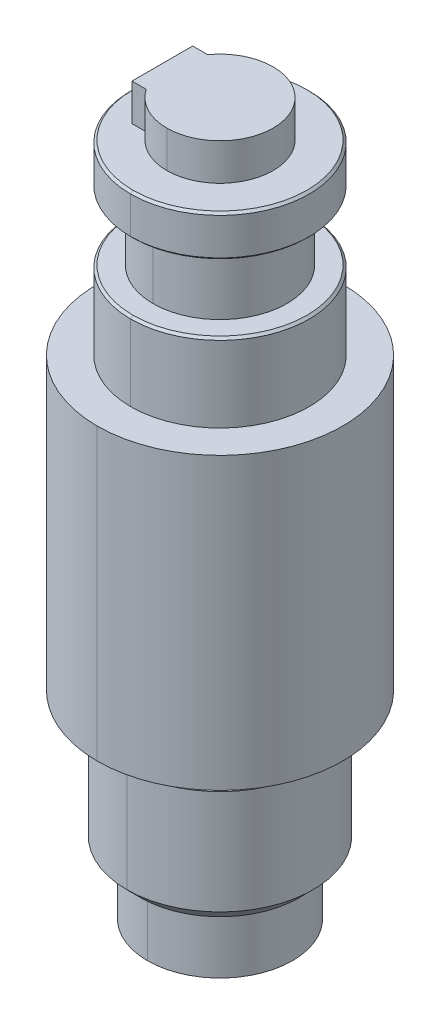
ISO-10303-21;
HEADER;
FILE_DESCRIPTION(('STEP AP214'),'2;1');
FILE_NAME('part.step','',(''),(''),'','','');
FILE_SCHEMA(('AUTOMOTIVE_DESIGN { 1 0 10303 214 1 1 1 1 }'));
ENDSEC;
DATA;
#1=APPLICATION_CONTEXT('core data for automotive mechanical design processes');
#2=APPLICATION_PROTOCOL_DEFINITION('international standard','automotive_design',2000,#1);
#3=PRODUCT_CONTEXT('',#1,'mechanical');
#4=PRODUCT('Part','Part','',(#3));
#5=PRODUCT_RELATED_PRODUCT_CATEGORY('part','',(#4));
#6=PRODUCT_DEFINITION_FORMATION('','',#4);
#7=PRODUCT_DEFINITION_CONTEXT('part definition',#1,'design');
#8=PRODUCT_DEFINITION('design','',#6,#7);
#9=PRODUCT_DEFINITION_SHAPE('','',#8);
#10=(LENGTH_UNIT() NAMED_UNIT(*) SI_UNIT(.MILLI.,.METRE.));
#11=(NAMED_UNIT(*) PLANE_ANGLE_UNIT() SI_UNIT($,.RADIAN.));
#12=(NAMED_UNIT(*) SI_UNIT($,.STERADIAN.) SOLID_ANGLE_UNIT());
#13=UNCERTAINTY_MEASURE_WITH_UNIT(LENGTH_MEASURE(1.E-05),#10,'distance_accuracy_value','');
#14=(GEOMETRIC_REPRESENTATION_CONTEXT(3) GLOBAL_UNCERTAINTY_ASSIGNED_CONTEXT((#13)) GLOBAL_UNIT_ASSIGNED_CONTEXT((#10,
#11,#12)) REPRESENTATION_CONTEXT('',''));
#15=CARTESIAN_POINT('',(0.,0.,0.));
#16=DIRECTION('',(0.,0.,1.));
#17=DIRECTION('',(1.,0.,0.));
#18=AXIS2_PLACEMENT_3D('',#15,#16,#17);
#19=CARTESIAN_POINT('',(18.1207496887531,35.6492982948195,29.9490663260963));
#20=DIRECTION('',(0.,1.,0.));
#21=DIRECTION('',(0.,0.,1.));
#22=AXIS2_PLACEMENT_3D('',#19,#20,#21);
#23=CYLINDRICAL_SURFACE('',#22,4.7592654031192);
#24=CARTESIAN_POINT('',(18.1207496887531,48.5409023996486,29.9490663260963));
#25=DIRECTION('',(0.,-1.,0.));
#26=DIRECTION('',(0.,0.,1.));
#27=AXIS2_PLACEMENT_3D('',#24,#25,#26);
#28=CIRCLE('',#27,4.7592654031192);
#29=CARTESIAN_POINT('',(18.1207496887531,48.5409023996486,25.1898009229771));
#30=VERTEX_POINT('',#29);
#31=CARTESIAN_POINT('',(18.1207496887531,48.5409023996486,34.7083317292155));
#32=VERTEX_POINT('',#31);
#33=EDGE_CURVE('E285',#30,#32,#28,.T.);
#34=ORIENTED_EDGE('',*,*,#33,.F.);
#35=DIRECTION('',(0.,1.,0.));
#36=VECTOR('',#35,1.);
#37=CARTESIAN_POINT('',(18.1207496887531,35.6492982948195,25.1898009229771));
#38=LINE('',#37,#36);
#39=CARTESIAN_POINT('',(18.1207496887531,51.8409023996486,25.1898009229771));
#40=VERTEX_POINT('',#39);
#41=EDGE_CURVE('E267',#30,#40,#38,.T.);
#42=ORIENTED_EDGE('',*,*,#41,.T.);
#43=CARTESIAN_POINT('',(18.1207496887531,51.8409023996486,29.9490663260963));
#44=DIRECTION('',(0.,1.,0.));
#45=DIRECTION('',(0.,0.,1.));
#46=AXIS2_PLACEMENT_3D('',#43,#44,#45);
#47=CIRCLE('',#46,4.7592654031192);
#48=CARTESIAN_POINT('',(18.1207496887531,51.8409023996486,34.7083317292155));
#49=VERTEX_POINT('',#48);
#50=EDGE_CURVE('E407',#49,#40,#47,.T.);
#51=ORIENTED_EDGE('',*,*,#50,.F.);
#52=DIRECTION('',(0.,1.,0.));
#53=VECTOR('',#52,1.);
#54=CARTESIAN_POINT('',(18.1207496887531,35.6492982948195,34.7083317292155));
#55=LINE('',#54,#53);
#56=EDGE_CURVE('E11',#32,#49,#55,.T.);
#57=ORIENTED_EDGE('',*,*,#56,.F.);
#58=EDGE_LOOP('',(#34,#42,#51,#57));
#59=FACE_BOUND('',#58,.T.);
#60=ADVANCED_FACE('F16',(#59),#23,.T.);
#61=CARTESIAN_POINT('',(18.1207496887531,35.6492982948195,29.9490663260963));
#62=DIRECTION('',(0.,1.,0.));
#63=DIRECTION('',(0.,0.,1.));
#64=AXIS2_PLACEMENT_3D('',#61,#62,#63);
#65=CYLINDRICAL_SURFACE('',#64,4.7592654031192);
#66=CARTESIAN_POINT('',(18.1207496887531,48.5409023996486,29.9490663260963));
#67=DIRECTION('',(0.,-1.,0.));
#68=DIRECTION('',(0.,0.,1.));
#69=AXIS2_PLACEMENT_3D('',#66,#67,#68);
#70=CIRCLE('',#69,4.7592654031192);
#71=CARTESIAN_POINT('',(14.185705016522,48.5409023996486,32.6260105923957));
#72=VERTEX_POINT('',#71);
#73=EDGE_CURVE('E289',#32,#72,#70,.T.);
#74=ORIENTED_EDGE('',*,*,#73,.F.);
#75=ORIENTED_EDGE('',*,*,#56,.T.);
#76=CARTESIAN_POINT('',(18.1207496887531,51.8409023996486,29.9490663260963));
#77=DIRECTION('',(0.,1.,0.));
#78=DIRECTION('',(0.,0.,1.));
#79=AXIS2_PLACEMENT_3D('',#76,#77,#78);
#80=CIRCLE('',#79,4.7592654031192);
#81=CARTESIAN_POINT('',(14.185705016522,51.8409023996486,32.6260105923957));
#82=VERTEX_POINT('',#81);
#83=EDGE_CURVE('E411',#82,#49,#80,.T.);
#84=ORIENTED_EDGE('',*,*,#83,.F.);
#85=DIRECTION('',(0.,1.,0.));
#86=VECTOR('',#85,1.);
#87=CARTESIAN_POINT('',(14.185705016522,35.6492982948195,32.6260105923957));
#88=LINE('',#87,#86);
#89=EDGE_CURVE('E449',#72,#82,#88,.T.);
#90=ORIENTED_EDGE('',*,*,#89,.F.);
#91=EDGE_LOOP('',(#74,#75,#84,#90));
#92=FACE_BOUND('',#91,.T.);
#93=ADVANCED_FACE('F1372',(#92),#65,.T.);
#94=CARTESIAN_POINT('',(18.1207496887531,-11.8590976003514,29.9490663260963));
#95=DIRECTION('',(0.,1.,0.));
#96=DIRECTION('',(0.,0.,1.));
#97=AXIS2_PLACEMENT_3D('',#94,#95,#96);
#98=CONICAL_SURFACE('',#97,6.60071544444866,1.15191730631626);
#99=CARTESIAN_POINT('',(18.1207496887531,-13.8590976003514,29.9490663260963));
#100=DIRECTION('',(0.,-1.,0.));
#101=DIRECTION('',(0.,0.,-1.));
#102=AXIS2_PLACEMENT_3D('',#99,#100,#101);
#103=CIRCLE('',#102,2.10864189664013);
#104=CARTESIAN_POINT('',(18.1207496887531,-13.8590976003514,27.8404244294561));
#105=VERTEX_POINT('',#104);
#106=CARTESIAN_POINT('',(18.1207496887531,-13.8590976003514,32.0577082227364));
#107=VERTEX_POINT('',#106);
#108=EDGE_CURVE('E428',#105,#107,#103,.T.);
#109=ORIENTED_EDGE('',*,*,#108,.F.);
#110=DIRECTION('',(0.,0.406736643075798,-0.913545457642602));
#111=VECTOR('',#110,1.);
#112=CARTESIAN_POINT('',(18.1207496887531,-11.8590976003514,23.3483508816477));
#113=LINE('',#112,#111);
#114=CARTESIAN_POINT('',(18.1207496887531,-11.9039390052735,23.4490663260963));
#115=VERTEX_POINT('',#114);
#116=EDGE_CURVE('E372',#105,#115,#113,.T.);
#117=ORIENTED_EDGE('',*,*,#116,.T.);
#118=CARTESIAN_POINT('',(18.1207496887531,-11.9039390052735,29.9490663260963));
#119=DIRECTION('',(0.,1.,0.));
#120=DIRECTION('',(0.,0.,1.));
#121=AXIS2_PLACEMENT_3D('',#118,#119,#120);
#122=CIRCLE('',#121,6.5);
#123=CARTESIAN_POINT('',(18.1207496887531,-11.9039390052735,36.4490663260963));
#124=VERTEX_POINT('',#123);
#125=EDGE_CURVE('E348',#124,#115,#122,.T.);
#126=ORIENTED_EDGE('',*,*,#125,.F.);
#127=DIRECTION('',(0.,0.406736643075798,0.913545457642602));
#128=VECTOR('',#127,1.);
#129=CARTESIAN_POINT('',(18.1207496887531,-11.8590976003514,36.549781770545));
#130=LINE('',#129,#128);
#131=EDGE_CURVE('E371',#107,#124,#130,.T.);
#132=ORIENTED_EDGE('',*,*,#131,.F.);
#133=EDGE_LOOP('',(#109,#117,#126,#132));
#134=FACE_BOUND('',#133,.T.);
#135=ADVANCED_FACE('F1376',(#134),#98,.T.);
#136=CARTESIAN_POINT('',(18.1207496887531,3.87090239964861,29.9490663260963));
#137=DIRECTION('',(0.,-1.,0.));
#138=DIRECTION('',(0.,0.,-1.));
#139=AXIS2_PLACEMENT_3D('',#136,#137,#138);
#140=CONICAL_SURFACE('',#139,8.35,0.78539816339745);
#141=CARTESIAN_POINT('',(18.1207496887531,5.14090239964862,29.9490663260963));
#142=DIRECTION('',(0.,1.,0.));
#143=DIRECTION('',(0.,0.,1.));
#144=AXIS2_PLACEMENT_3D('',#141,#142,#143);
#145=CIRCLE('',#144,7.08);
#146=CARTESIAN_POINT('',(18.1207496887531,5.14090239964862,37.0290663260963));
#147=VERTEX_POINT('',#146);
#148=CARTESIAN_POINT('',(18.1207496887531,5.14090239964862,22.8690663260963));
#149=VERTEX_POINT('',#148);
#150=EDGE_CURVE('E524',#147,#149,#145,.T.);
#151=ORIENTED_EDGE('',*,*,#150,.F.);
#152=DIRECTION('',(0.,-0.707106781186547,0.707106781186549));
#153=VECTOR('',#152,1.);
#154=CARTESIAN_POINT('',(18.1207496887531,3.87090239964861,38.2990663260963));
#155=LINE('',#154,#153);
#156=CARTESIAN_POINT('',(18.1207496887531,3.87090239964861,38.2990663260963));
#157=VERTEX_POINT('',#156);
#158=EDGE_CURVE('E424',#147,#157,#155,.T.);
#159=ORIENTED_EDGE('',*,*,#158,.T.);
#160=CARTESIAN_POINT('',(18.1207496887531,3.87090239964861,29.9490663260963));
#161=DIRECTION('',(0.,-1.,0.));
#162=DIRECTION('',(0.,0.,1.));
#163=AXIS2_PLACEMENT_3D('',#160,#161,#162);
#164=CIRCLE('',#163,8.35);
#165=CARTESIAN_POINT('',(18.1207496887531,3.87090239964861,21.5990663260963));
#166=VERTEX_POINT('',#165);
#167=EDGE_CURVE('E301',#166,#157,#164,.T.);
#168=ORIENTED_EDGE('',*,*,#167,.F.);
#169=DIRECTION('',(0.,-0.707106781186547,-0.707106781186549));
#170=VECTOR('',#169,1.);
#171=CARTESIAN_POINT('',(18.1207496887531,3.87090239964861,21.5990663260963));
#172=LINE('',#171,#170);
#173=EDGE_CURVE('E385',#149,#166,#172,.T.);
#174=ORIENTED_EDGE('',*,*,#173,.F.);
#175=EDGE_LOOP('',(#151,#159,#168,#174));
#176=FACE_BOUND('',#175,.T.);
#177=ADVANCED_FACE('F1087',(#176),#140,.T.);
#178=CARTESIAN_POINT('',(18.1207496887531,-6.73409760035138,29.9490663260963));
#179=DIRECTION('',(0.,1.,0.));
#180=DIRECTION('',(0.,0.,1.));
#181=AXIS2_PLACEMENT_3D('',#178,#179,#180);
#182=CONICAL_SURFACE('',#181,7.08,0.785398163397445);
#183=CARTESIAN_POINT('',(18.1207496887531,-6.73409760035138,29.9490663260963));
#184=DIRECTION('',(0.,-1.,0.));
#185=DIRECTION('',(0.,0.,-1.));
#186=AXIS2_PLACEMENT_3D('',#183,#184,#185);
#187=CIRCLE('',#186,7.08);
#188=CARTESIAN_POINT('',(18.1207496887531,-6.73409760035138,22.8690663260963));
#189=VERTEX_POINT('',#188);
#190=CARTESIAN_POINT('',(18.1207496887531,-6.73409760035138,37.0290663260963));
#191=VERTEX_POINT('',#190);
#192=EDGE_CURVE('E445',#189,#191,#187,.T.);
#193=ORIENTED_EDGE('',*,*,#192,.F.);
#194=DIRECTION('',(0.,0.707106781186551,-0.707106781186545));
#195=VECTOR('',#194,1.);
#196=CARTESIAN_POINT('',(18.1207496887531,-6.73409760035138,22.8690663260963));
#197=LINE('',#196,#195);
#198=CARTESIAN_POINT('',(18.1207496887531,-5.46409760035138,21.5990663260963));
#199=VERTEX_POINT('',#198);
#200=EDGE_CURVE('E329',#189,#199,#197,.T.);
#201=ORIENTED_EDGE('',*,*,#200,.T.);
#202=CARTESIAN_POINT('',(18.1207496887531,-5.46409760035138,29.9490663260963));
#203=DIRECTION('',(0.,1.,0.));
#204=DIRECTION('',(0.,0.,-1.));
#205=AXIS2_PLACEMENT_3D('',#202,#203,#204);
#206=CIRCLE('',#205,8.35);
#207=CARTESIAN_POINT('',(18.1207496887531,-5.46409760035138,38.2990663260963));
#208=VERTEX_POINT('',#207);
#209=EDGE_CURVE('E27',#208,#199,#206,.T.);
#210=ORIENTED_EDGE('',*,*,#209,.F.);
#211=DIRECTION('',(0.,0.707106781186551,0.707106781186545));
#212=VECTOR('',#211,1.);
#213=CARTESIAN_POINT('',(18.1207496887531,-6.73409760035138,37.0290663260963));
#214=LINE('',#213,#212);
#215=EDGE_CURVE('E440',#191,#208,#214,.T.);
#216=ORIENTED_EDGE('',*,*,#215,.F.);
#217=EDGE_LOOP('',(#193,#201,#210,#216));
#218=FACE_BOUND('',#217,.T.);
#219=ADVANCED_FACE('F650',(#218),#182,.T.);
#220=CARTESIAN_POINT('',(18.1207496887531,5.14090239964862,29.9490663260963));
#221=DIRECTION('',(0.,-1.,0.));
#222=DIRECTION('',(0.,0.,-1.));
#223=AXIS2_PLACEMENT_3D('',#220,#221,#222);
#224=CYLINDRICAL_SURFACE('',#223,8.35);
#225=ORIENTED_EDGE('',*,*,#167,.T.);
#226=DIRECTION('',(0.,-1.,0.));
#227=VECTOR('',#226,1.);
#228=CARTESIAN_POINT('',(18.1207496887531,5.14090239964862,38.2990663260963));
#229=LINE('',#228,#227);
#230=EDGE_CURVE('E313',#157,#208,#229,.T.);
#231=ORIENTED_EDGE('',*,*,#230,.T.);
#232=ORIENTED_EDGE('',*,*,#209,.T.);
#233=DIRECTION('',(0.,-1.,0.));
#234=VECTOR('',#233,1.);
#235=CARTESIAN_POINT('',(18.1207496887531,5.14090239964862,21.5990663260963));
#236=LINE('',#235,#234);
#237=EDGE_CURVE('E317',#166,#199,#236,.T.);
#238=ORIENTED_EDGE('',*,*,#237,.F.);
#239=EDGE_LOOP('',(#225,#231,#232,#238));
#240=FACE_BOUND('',#239,.T.);
#241=ADVANCED_FACE('F654',(#240),#224,.T.);
#242=CARTESIAN_POINT('',(18.1207496887531,11.6506787104989,29.9490663260963));
#243=DIRECTION('',(0.,-1.,0.));
#244=DIRECTION('',(0.,0.,-1.));
#245=AXIS2_PLACEMENT_3D('',#242,#243,#244);
#246=CYLINDRICAL_SURFACE('',#245,6.5);
#247=CARTESIAN_POINT('',(18.1207496887531,-6.73409760035138,29.9490663260963));
#248=DIRECTION('',(0.,1.,0.));
#249=DIRECTION('',(0.,0.,-1.));
#250=AXIS2_PLACEMENT_3D('',#247,#248,#249);
#251=CIRCLE('',#250,6.5);
#252=CARTESIAN_POINT('',(18.1207496887531,-6.73409760035138,36.4490663260963));
#253=VERTEX_POINT('',#252);
#254=CARTESIAN_POINT('',(18.1207496887531,-6.73409760035138,23.4490663260963));
#255=VERTEX_POINT('',#254);
#256=EDGE_CURVE('E261',#253,#255,#251,.T.);
#257=ORIENTED_EDGE('',*,*,#256,.F.);
#258=DIRECTION('',(0.,-1.,0.));
#259=VECTOR('',#258,1.);
#260=CARTESIAN_POINT('',(18.1207496887531,11.6506787104989,36.4490663260963));
#261=LINE('',#260,#259);
#262=EDGE_CURVE('E256',#253,#124,#261,.T.);
#263=ORIENTED_EDGE('',*,*,#262,.T.);
#264=ORIENTED_EDGE('',*,*,#125,.T.);
#265=DIRECTION('',(0.,-1.,0.));
#266=VECTOR('',#265,1.);
#267=CARTESIAN_POINT('',(18.1207496887531,11.6506787104989,23.4490663260963));
#268=LINE('',#267,#266);
#269=EDGE_CURVE('E260',#255,#115,#268,.T.);
#270=ORIENTED_EDGE('',*,*,#269,.F.);
#271=EDGE_LOOP('',(#257,#263,#264,#270));
#272=FACE_BOUND('',#271,.T.);
#273=ADVANCED_FACE('F635',(#272),#246,.T.);
#274=CARTESIAN_POINT('',(18.1207496887531,38.8409023996486,29.9490663260963));
#275=DIRECTION('',(0.,-1.,0.));
#276=DIRECTION('',(0.,0.,-1.));
#277=AXIS2_PLACEMENT_3D('',#274,#275,#276);
#278=CONICAL_SURFACE('',#277,7.8,0.785398163397448);
#279=CARTESIAN_POINT('',(18.1207496887531,38.8409023996486,29.9490663260963));
#280=DIRECTION('',(0.,1.,0.));
#281=DIRECTION('',(0.,0.,1.));
#282=AXIS2_PLACEMENT_3D('',#279,#280,#281);
#283=CIRCLE('',#282,7.8);
#284=CARTESIAN_POINT('',(18.1207496887531,38.8409023996486,37.7490663260963));
#285=VERTEX_POINT('',#284);
#286=CARTESIAN_POINT('',(18.1207496887531,38.8409023996486,22.1490663260963));
#287=VERTEX_POINT('',#286);
#288=EDGE_CURVE('E272',#285,#287,#283,.T.);
#289=ORIENTED_EDGE('',*,*,#288,.F.);
#290=DIRECTION('',(0.,-0.707106781186548,0.707106781186548));
#291=VECTOR('',#290,1.);
#292=CARTESIAN_POINT('',(18.1207496887531,38.8409023996486,37.7490663260963));
#293=LINE('',#292,#291);
#294=CARTESIAN_POINT('',(18.1207496887531,38.6409023996487,37.9490663260963));
#295=VERTEX_POINT('',#294);
#296=EDGE_CURVE('E322',#285,#295,#293,.T.);
#297=ORIENTED_EDGE('',*,*,#296,.T.);
#298=CARTESIAN_POINT('',(18.1207496887531,38.6409023996487,29.9490663260963));
#299=DIRECTION('',(0.,-1.,0.));
#300=DIRECTION('',(0.,0.,1.));
#301=AXIS2_PLACEMENT_3D('',#298,#299,#300);
#302=CIRCLE('',#301,8.);
#303=CARTESIAN_POINT('',(18.1207496887531,38.6409023996487,21.9490663260963));
#304=VERTEX_POINT('',#303);
#305=EDGE_CURVE('E221',#304,#295,#302,.T.);
#306=ORIENTED_EDGE('',*,*,#305,.F.);
#307=DIRECTION('',(0.,-0.707106781186548,-0.707106781186548));
#308=VECTOR('',#307,1.);
#309=CARTESIAN_POINT('',(18.1207496887531,38.8409023996486,22.1490663260963));
#310=LINE('',#309,#308);
#311=EDGE_CURVE('E307',#287,#304,#310,.T.);
#312=ORIENTED_EDGE('',*,*,#311,.F.);
#313=EDGE_LOOP('',(#289,#297,#306,#312));
#314=FACE_BOUND('',#313,.T.);
#315=ADVANCED_FACE('F1097',(#314),#278,.T.);
#316=CARTESIAN_POINT('',(18.1207496887531,30.5409023996486,29.8795368386777));
#317=DIRECTION('',(0.,-1.,0.));
#318=DIRECTION('',(0.,0.,-1.));
#319=AXIS2_PLACEMENT_3D('',#316,#317,#318);
#320=CYLINDRICAL_SURFACE('',#319,5.3330761790222);
#321=CARTESIAN_POINT('',(18.1207496887531,5.84090239964862,29.8795368386777));
#322=DIRECTION('',(0.,-1.,0.));
#323=DIRECTION('',(0.,0.,-1.));
#324=AXIS2_PLACEMENT_3D('',#321,#322,#323);
#325=CIRCLE('',#324,5.3330761790222);
#326=CARTESIAN_POINT('',(18.1207496887531,5.84090239964862,24.5464606596556));
#327=VERTEX_POINT('',#326);
#328=CARTESIAN_POINT('',(18.1207496887531,5.84090239964862,35.2126130176999));
#329=VERTEX_POINT('',#328);
#330=EDGE_CURVE('E281',#327,#329,#325,.T.);
#331=ORIENTED_EDGE('',*,*,#330,.T.);
#332=DIRECTION('',(0.,-1.,0.));
#333=VECTOR('',#332,1.);
#334=CARTESIAN_POINT('',(18.1207496887531,30.5409023996486,35.2126130176999));
#335=LINE('',#334,#333);
#336=CARTESIAN_POINT('',(18.1207496887531,5.14090239964862,35.2126130176999));
#337=VERTEX_POINT('',#336);
#338=EDGE_CURVE('E273',#329,#337,#335,.T.);
#339=ORIENTED_EDGE('',*,*,#338,.T.);
#340=CARTESIAN_POINT('',(18.1207496887531,5.14090239964862,29.8795368386777));
#341=DIRECTION('',(0.,1.,0.));
#342=DIRECTION('',(0.,0.,1.));
#343=AXIS2_PLACEMENT_3D('',#340,#341,#342);
#344=CIRCLE('',#343,5.3330761790222);
#345=CARTESIAN_POINT('',(18.1207496887531,5.14090239964862,24.5464606596556));
#346=VERTEX_POINT('',#345);
#347=EDGE_CURVE('E318',#337,#346,#344,.T.);
#348=ORIENTED_EDGE('',*,*,#347,.T.);
#349=DIRECTION('',(0.,-1.,0.));
#350=VECTOR('',#349,1.);
#351=CARTESIAN_POINT('',(18.1207496887531,30.5409023996486,24.5464606596556));
#352=LINE('',#351,#350);
#353=EDGE_CURVE('E268',#327,#346,#352,.T.);
#354=ORIENTED_EDGE('',*,*,#353,.F.);
#355=EDGE_LOOP('',(#331,#339,#348,#354));
#356=FACE_BOUND('',#355,.T.);
#357=ADVANCED_FACE('F511',(#356),#320,.T.);
#358=CARTESIAN_POINT('',(18.1207496887531,5.84090239964862,29.9490663260963));
#359=DIRECTION('',(0.,-1.,0.));
#360=DIRECTION('',(0.,0.,-1.));
#361=AXIS2_PLACEMENT_3D('',#358,#359,#360);
#362=CYLINDRICAL_SURFACE('',#361,6.);
#363=CARTESIAN_POINT('',(18.1207496887531,44.8409023996486,29.9490663260963));
#364=DIRECTION('',(0.,-1.,0.));
#365=DIRECTION('',(0.,0.,-1.));
#366=AXIS2_PLACEMENT_3D('',#363,#364,#365);
#367=CIRCLE('',#366,6.);
#368=CARTESIAN_POINT('',(18.1207496887531,44.8409023996486,23.9490663260963));
#369=VERTEX_POINT('',#368);
#370=CARTESIAN_POINT('',(18.1207496887531,44.8409023996486,35.9490663260963));
#371=VERTEX_POINT('',#370);
#372=EDGE_CURVE('E384',#369,#371,#367,.T.);
#373=ORIENTED_EDGE('',*,*,#372,.T.);
#374=DIRECTION('',(0.,-1.,0.));
#375=VECTOR('',#374,1.);
#376=CARTESIAN_POINT('',(18.1207496887531,5.84090239964862,35.9490663260963));
#377=LINE('',#376,#375);
#378=CARTESIAN_POINT('',(18.1207496887531,38.8409023996486,35.9490663260963));
#379=VERTEX_POINT('',#378);
#380=EDGE_CURVE('E327',#371,#379,#377,.T.);
#381=ORIENTED_EDGE('',*,*,#380,.T.);
#382=CARTESIAN_POINT('',(18.1207496887531,38.8409023996486,29.9490663260963));
#383=DIRECTION('',(0.,-1.,0.));
#384=DIRECTION('',(0.,0.,-1.));
#385=AXIS2_PLACEMENT_3D('',#382,#383,#384);
#386=CIRCLE('',#385,6.);
#387=CARTESIAN_POINT('',(18.1207496887531,38.8409023996486,23.9490663260963));
#388=VERTEX_POINT('',#387);
#389=EDGE_CURVE('E328',#388,#379,#386,.T.);
#390=ORIENTED_EDGE('',*,*,#389,.F.);
#391=DIRECTION('',(0.,-1.,0.));
#392=VECTOR('',#391,1.);
#393=CARTESIAN_POINT('',(18.1207496887531,5.84090239964862,23.9490663260963));
#394=LINE('',#393,#392);
#395=EDGE_CURVE('E308',#369,#388,#394,.T.);
#396=ORIENTED_EDGE('',*,*,#395,.F.);
#397=EDGE_LOOP('',(#373,#381,#390,#396));
#398=FACE_BOUND('',#397,.T.);
#399=ADVANCED_FACE('F1237',(#398),#362,.T.);
#400=CARTESIAN_POINT('',(18.1207496887531,44.8409023996486,29.9490663260963));
#401=DIRECTION('',(0.,1.,0.));
#402=DIRECTION('',(0.,0.,1.));
#403=AXIS2_PLACEMENT_3D('',#400,#401,#402);
#404=CONICAL_SURFACE('',#403,7.8,0.785398163397448);
#405=CARTESIAN_POINT('',(18.1207496887531,44.8409023996486,29.9490663260963));
#406=DIRECTION('',(0.,-1.,0.));
#407=DIRECTION('',(0.,0.,-1.));
#408=AXIS2_PLACEMENT_3D('',#405,#406,#407);
#409=CIRCLE('',#408,7.8);
#410=CARTESIAN_POINT('',(18.1207496887531,44.8409023996486,22.1490663260963));
#411=VERTEX_POINT('',#410);
#412=CARTESIAN_POINT('',(18.1207496887531,44.8409023996486,37.7490663260963));
#413=VERTEX_POINT('',#412);
#414=EDGE_CURVE('E492',#411,#413,#409,.T.);
#415=ORIENTED_EDGE('',*,*,#414,.F.);
#416=DIRECTION('',(0.,0.707106781186548,-0.707106781186548));
#417=VECTOR('',#416,1.);
#418=CARTESIAN_POINT('',(18.1207496887531,44.8409023996486,22.1490663260963));
#419=LINE('',#418,#417);
#420=CARTESIAN_POINT('',(18.1207496887531,45.0409023996486,21.9490663260963));
#421=VERTEX_POINT('',#420);
#422=EDGE_CURVE('E380',#411,#421,#419,.T.);
#423=ORIENTED_EDGE('',*,*,#422,.T.);
#424=CARTESIAN_POINT('',(18.1207496887531,45.0409023996486,29.9490663260963));
#425=DIRECTION('',(0.,1.,0.));
#426=DIRECTION('',(0.,0.,-1.));
#427=AXIS2_PLACEMENT_3D('',#424,#425,#426);
#428=CIRCLE('',#427,8.);
#429=CARTESIAN_POINT('',(18.1207496887531,45.0409023996486,37.9490663260963));
#430=VERTEX_POINT('',#429);
#431=EDGE_CURVE('E220',#430,#421,#428,.T.);
#432=ORIENTED_EDGE('',*,*,#431,.F.);
#433=DIRECTION('',(0.,0.707106781186548,0.707106781186548));
#434=VECTOR('',#433,1.);
#435=CARTESIAN_POINT('',(18.1207496887531,44.8409023996486,37.7490663260963));
#436=LINE('',#435,#434);
#437=EDGE_CURVE('E276',#413,#430,#436,.T.);
#438=ORIENTED_EDGE('',*,*,#437,.F.);
#439=EDGE_LOOP('',(#415,#423,#432,#438));
#440=FACE_BOUND('',#439,.T.);
#441=ADVANCED_FACE('F18',(#440),#404,.T.);
#442=CARTESIAN_POINT('',(18.1207496887531,5.84090239964862,29.9490663260963));
#443=DIRECTION('',(0.,-1.,0.));
#444=DIRECTION('',(0.,0.,-1.));
#445=AXIS2_PLACEMENT_3D('',#442,#443,#444);
#446=CYLINDRICAL_SURFACE('',#445,8.);
#447=CARTESIAN_POINT('',(18.1207496887531,48.3409023996486,29.9490663260963));
#448=DIRECTION('',(0.,-1.,0.));
#449=DIRECTION('',(0.,0.,1.));
#450=AXIS2_PLACEMENT_3D('',#447,#448,#449);
#451=CIRCLE('',#450,8.);
#452=CARTESIAN_POINT('',(18.1207496887531,48.3409023996486,21.9490663260963));
#453=VERTEX_POINT('',#452);
#454=CARTESIAN_POINT('',(18.1207496887531,48.3409023996486,37.9490663260963));
#455=VERTEX_POINT('',#454);
#456=EDGE_CURVE('E208',#453,#455,#451,.T.);
#457=ORIENTED_EDGE('',*,*,#456,.T.);
#458=DIRECTION('',(0.,-1.,0.));
#459=VECTOR('',#458,1.);
#460=CARTESIAN_POINT('',(18.1207496887531,5.84090239964862,37.9490663260963));
#461=LINE('',#460,#459);
#462=EDGE_CURVE('E243',#455,#430,#461,.T.);
#463=ORIENTED_EDGE('',*,*,#462,.T.);
#464=ORIENTED_EDGE('',*,*,#431,.T.);
#465=DIRECTION('',(0.,-1.,0.));
#466=VECTOR('',#465,1.);
#467=CARTESIAN_POINT('',(18.1207496887531,5.84090239964862,21.9490663260963));
#468=LINE('',#467,#466);
#469=EDGE_CURVE('E234',#453,#421,#468,.T.);
#470=ORIENTED_EDGE('',*,*,#469,.F.);
#471=EDGE_LOOP('',(#457,#463,#464,#470));
#472=FACE_BOUND('',#471,.T.);
#473=ADVANCED_FACE('F235',(#472),#446,.T.);
#474=CARTESIAN_POINT('',(18.1207496887531,48.3409023996486,29.9490663260963));
#475=DIRECTION('',(0.,-1.,0.));
#476=DIRECTION('',(0.,0.,-1.));
#477=AXIS2_PLACEMENT_3D('',#474,#475,#476);
#478=CONICAL_SURFACE('',#477,8.,0.78539816339744);
#479=CARTESIAN_POINT('',(18.1207496887531,48.5409023996486,29.9490663260963));
#480=DIRECTION('',(0.,1.,0.));
#481=DIRECTION('',(0.,0.,1.));
#482=AXIS2_PLACEMENT_3D('',#479,#480,#481);
#483=CIRCLE('',#482,7.8);
#484=CARTESIAN_POINT('',(18.1207496887531,48.5409023996486,37.7490663260963));
#485=VERTEX_POINT('',#484);
#486=CARTESIAN_POINT('',(18.1207496887531,48.5409023996486,22.1490663260963));
#487=VERTEX_POINT('',#486);
#488=EDGE_CURVE('E231',#485,#487,#483,.T.);
#489=ORIENTED_EDGE('',*,*,#488,.F.);
#490=DIRECTION('',(0.,-0.707106781186554,0.707106781186541));
#491=VECTOR('',#490,1.);
#492=CARTESIAN_POINT('',(18.1207496887531,48.3409023996486,37.9490663260963));
#493=LINE('',#492,#491);
#494=EDGE_CURVE('E214',#485,#455,#493,.T.);
#495=ORIENTED_EDGE('',*,*,#494,.T.);
#496=ORIENTED_EDGE('',*,*,#456,.F.);
#497=DIRECTION('',(0.,-0.707106781186554,-0.707106781186541));
#498=VECTOR('',#497,1.);
#499=CARTESIAN_POINT('',(18.1207496887531,48.3409023996486,21.9490663260963));
#500=LINE('',#499,#498);
#501=EDGE_CURVE('E211',#487,#453,#500,.T.);
#502=ORIENTED_EDGE('',*,*,#501,.F.);
#503=EDGE_LOOP('',(#489,#495,#496,#502));
#504=FACE_BOUND('',#503,.T.);
#505=ADVANCED_FACE('F210',(#504),#478,.T.);
#506=CARTESIAN_POINT('',(18.1207496887531,5.84090239964862,29.9490663260963));
#507=DIRECTION('',(0.,-1.,0.));
#508=DIRECTION('',(0.,0.,-1.));
#509=AXIS2_PLACEMENT_3D('',#506,#507,#508);
#510=CYLINDRICAL_SURFACE('',#509,8.);
#511=ORIENTED_EDGE('',*,*,#305,.T.);
#512=DIRECTION('',(0.,-1.,0.));
#513=VECTOR('',#512,1.);
#514=CARTESIAN_POINT('',(18.1207496887531,5.84090239964862,37.9490663260963));
#515=LINE('',#514,#513);
#516=CARTESIAN_POINT('',(18.1207496887531,31.8409023996486,37.9490663260963));
#517=VERTEX_POINT('',#516);
#518=EDGE_CURVE('E296',#295,#517,#515,.T.);
#519=ORIENTED_EDGE('',*,*,#518,.T.);
#520=CARTESIAN_POINT('',(18.1207496887531,31.8409023996486,29.9490663260963));
#521=DIRECTION('',(0.,1.,0.));
#522=DIRECTION('',(0.,0.,1.));
#523=AXIS2_PLACEMENT_3D('',#520,#521,#522);
#524=CIRCLE('',#523,8.);
#525=CARTESIAN_POINT('',(18.1207496887531,31.8409023996486,21.9490663260963));
#526=VERTEX_POINT('',#525);
#527=EDGE_CURVE('E42',#517,#526,#524,.T.);
#528=ORIENTED_EDGE('',*,*,#527,.T.);
#529=DIRECTION('',(0.,-1.,0.));
#530=VECTOR('',#529,1.);
#531=CARTESIAN_POINT('',(18.1207496887531,5.84090239964862,21.9490663260963));
#532=LINE('',#531,#530);
#533=EDGE_CURVE('E299',#304,#526,#532,.T.);
#534=ORIENTED_EDGE('',*,*,#533,.F.);
#535=EDGE_LOOP('',(#511,#519,#528,#534));
#536=FACE_BOUND('',#535,.T.);
#537=ADVANCED_FACE('F1126',(#536),#510,.T.);
#538=CARTESIAN_POINT('',(18.1207496887531,38.8672892992485,29.9490663260963));
#539=DIRECTION('',(0.,-1.,0.));
#540=DIRECTION('',(0.,0.,-1.));
#541=AXIS2_PLACEMENT_3D('',#538,#539,#540);
#542=CYLINDRICAL_SURFACE('',#541,11.);
#543=DIRECTION('',(0.,-1.,0.));
#544=VECTOR('',#543,1.);
#545=CARTESIAN_POINT('',(18.1207496887531,38.8672892992485,40.9490663260963));
#546=LINE('',#545,#544);
#547=CARTESIAN_POINT('',(18.1207496887531,31.8409023996486,40.9490663260963));
#548=VERTEX_POINT('',#547);
#549=CARTESIAN_POINT('',(18.1207496887531,5.84090239964862,40.9490663260963));
#550=VERTEX_POINT('',#549);
#551=EDGE_CURVE('E341',#548,#550,#546,.T.);
#552=ORIENTED_EDGE('',*,*,#551,.F.);
#553=CARTESIAN_POINT('',(18.1207496887531,31.8409023996486,29.9490663260963));
#554=DIRECTION('',(0.,1.,0.));
#555=DIRECTION('',(0.,0.,1.));
#556=AXIS2_PLACEMENT_3D('',#553,#554,#555);
#557=CIRCLE('',#556,11.);
#558=CARTESIAN_POINT('',(18.1207496887531,31.8409023996486,18.9490663260963));
#559=VERTEX_POINT('',#558);
#560=EDGE_CURVE('E355',#559,#548,#557,.T.);
#561=ORIENTED_EDGE('',*,*,#560,.F.);
#562=DIRECTION('',(0.,-1.,0.));
#563=VECTOR('',#562,1.);
#564=CARTESIAN_POINT('',(18.1207496887531,38.8672892992485,18.9490663260963));
#565=LINE('',#564,#563);
#566=CARTESIAN_POINT('',(18.1207496887531,5.84090239964862,18.9490663260963));
#567=VERTEX_POINT('',#566);
#568=EDGE_CURVE('E352',#559,#567,#565,.T.);
#569=ORIENTED_EDGE('',*,*,#568,.T.);
#570=CARTESIAN_POINT('',(18.1207496887531,5.84090239964862,29.9490663260963));
#571=DIRECTION('',(0.,-1.,0.));
#572=DIRECTION('',(0.,0.,-1.));
#573=AXIS2_PLACEMENT_3D('',#570,#571,#572);
#574=CIRCLE('',#573,11.);
#575=EDGE_CURVE('E359',#550,#567,#574,.T.);
#576=ORIENTED_EDGE('',*,*,#575,.F.);
#577=EDGE_LOOP('',(#552,#561,#569,#576));
#578=FACE_BOUND('',#577,.T.);
#579=ADVANCED_FACE('F575',(#578),#542,.T.);
#580=CARTESIAN_POINT('',(18.1207496887531,31.8409023996486,29.9490663260963));
#581=DIRECTION('',(0.,1.,0.));
#582=DIRECTION('',(1.,0.,0.));
#583=AXIS2_PLACEMENT_3D('',#580,#581,#582);
#584=PLANE('',#583);
#585=CARTESIAN_POINT('',(18.1207496887531,31.8409023996486,29.9490663260963));
#586=DIRECTION('',(0.,1.,0.));
#587=DIRECTION('',(0.,0.,1.));
#588=AXIS2_PLACEMENT_3D('',#585,#586,#587);
#589=CIRCLE('',#588,8.);
#590=EDGE_CURVE('E20',#526,#517,#589,.T.);
#591=ORIENTED_EDGE('',*,*,#590,.F.);
#592=ORIENTED_EDGE('',*,*,#527,.F.);
#593=EDGE_LOOP('',(#591,#592));
#594=FACE_BOUND('',#593,.T.);
#595=ORIENTED_EDGE('',*,*,#560,.T.);
#596=CARTESIAN_POINT('',(18.1207496887531,31.8409023996486,29.9490663260963));
#597=DIRECTION('',(0.,1.,0.));
#598=DIRECTION('',(0.,0.,1.));
#599=AXIS2_PLACEMENT_3D('',#596,#597,#598);
#600=CIRCLE('',#599,11.);
#601=EDGE_CURVE('E337',#548,#559,#600,.T.);
#602=ORIENTED_EDGE('',*,*,#601,.T.);
#603=EDGE_LOOP('',(#595,#602));
#604=FACE_BOUND('',#603,.T.);
#605=ADVANCED_FACE('F584',(#594,#604),#584,.T.);
#606=CARTESIAN_POINT('',(18.1207496887531,5.84090239964862,29.9490663260963));
#607=DIRECTION('',(0.,-1.,0.));
#608=DIRECTION('',(0.,0.,-1.));
#609=AXIS2_PLACEMENT_3D('',#606,#607,#608);
#610=CYLINDRICAL_SURFACE('',#609,8.);
#611=ORIENTED_EDGE('',*,*,#518,.F.);
#612=CARTESIAN_POINT('',(18.1207496887531,38.6409023996487,29.9490663260963));
#613=DIRECTION('',(0.,-1.,0.));
#614=DIRECTION('',(0.,0.,1.));
#615=AXIS2_PLACEMENT_3D('',#612,#613,#614);
#616=CIRCLE('',#615,8.);
#617=EDGE_CURVE('E303',#295,#304,#616,.T.);
#618=ORIENTED_EDGE('',*,*,#617,.T.);
#619=ORIENTED_EDGE('',*,*,#533,.T.);
#620=ORIENTED_EDGE('',*,*,#590,.T.);
#621=EDGE_LOOP('',(#611,#618,#619,#620));
#622=FACE_BOUND('',#621,.T.);
#623=ADVANCED_FACE('F1271',(#622),#610,.T.);
#624=CARTESIAN_POINT('',(18.1207496887531,48.5409023996486,29.9490663260963));
#625=DIRECTION('',(0.,1.,0.));
#626=DIRECTION('',(1.,0.,0.));
#627=AXIS2_PLACEMENT_3D('',#624,#625,#626);
#628=PLANE('',#627);
#629=CARTESIAN_POINT('',(18.1207496887531,48.5409023996486,29.9490663260963));
#630=DIRECTION('',(0.,-1.,0.));
#631=DIRECTION('',(0.,0.,1.));
#632=AXIS2_PLACEMENT_3D('',#629,#630,#631);
#633=CIRCLE('',#632,4.7592654031192);
#634=CARTESIAN_POINT('',(14.2488256501255,48.5409023996486,27.181610560158));
#635=VERTEX_POINT('',#634);
#636=EDGE_CURVE('E262',#635,#30,#633,.T.);
#637=ORIENTED_EDGE('',*,*,#636,.T.);
#638=ORIENTED_EDGE('',*,*,#33,.T.);
#639=ORIENTED_EDGE('',*,*,#73,.T.);
#640=DIRECTION('',(-1.,0.,0.));
#641=VECTOR('',#640,1.);
#642=CARTESIAN_POINT('',(12.9041244373439,48.5409023996486,32.6260105923957));
#643=LINE('',#642,#641);
#644=CARTESIAN_POINT('',(12.9041244373439,48.5409023996486,32.6260105923957));
#645=VERTEX_POINT('',#644);
#646=EDGE_CURVE('E452',#72,#645,#643,.T.);
#647=ORIENTED_EDGE('',*,*,#646,.T.);
#648=DIRECTION('',(0.,0.,-1.));
#649=VECTOR('',#648,1.);
#650=CARTESIAN_POINT('',(12.9041244373439,48.5409023996486,27.181610560158));
#651=LINE('',#650,#649);
#652=CARTESIAN_POINT('',(12.9041244373439,48.5409023996486,27.181610560158));
#653=VERTEX_POINT('',#652);
#654=EDGE_CURVE('E499',#645,#653,#651,.T.);
#655=ORIENTED_EDGE('',*,*,#654,.T.);
#656=DIRECTION('',(1.,0.,0.));
#657=VECTOR('',#656,1.);
#658=CARTESIAN_POINT('',(14.2488256501255,48.5409023996486,27.181610560158));
#659=LINE('',#658,#657);
#660=EDGE_CURVE('E432',#653,#635,#659,.T.);
#661=ORIENTED_EDGE('',*,*,#660,.T.);
#662=EDGE_LOOP('',(#637,#638,#639,#647,#655,#661));
#663=FACE_BOUND('',#662,.T.);
#664=CARTESIAN_POINT('',(18.1207496887531,48.5409023996486,29.9490663260963));
#665=DIRECTION('',(0.,1.,0.));
#666=DIRECTION('',(0.,0.,1.));
#667=AXIS2_PLACEMENT_3D('',#664,#665,#666);
#668=CIRCLE('',#667,7.8);
#669=EDGE_CURVE('E229',#487,#485,#668,.T.);
#670=ORIENTED_EDGE('',*,*,#669,.T.);
#671=ORIENTED_EDGE('',*,*,#488,.T.);
#672=EDGE_LOOP('',(#670,#671));
#673=FACE_BOUND('',#672,.T.);
#674=ADVANCED_FACE('F600',(#663,#673),#628,.T.);
#675=CARTESIAN_POINT('',(18.1207496887531,48.3409023996486,29.9490663260963));
#676=DIRECTION('',(0.,-1.,0.));
#677=DIRECTION('',(0.,0.,-1.));
#678=AXIS2_PLACEMENT_3D('',#675,#676,#677);
#679=CONICAL_SURFACE('',#678,8.,0.78539816339744);
#680=ORIENTED_EDGE('',*,*,#494,.F.);
#681=ORIENTED_EDGE('',*,*,#669,.F.);
#682=ORIENTED_EDGE('',*,*,#501,.T.);
#683=CARTESIAN_POINT('',(18.1207496887531,48.3409023996486,29.9490663260963));
#684=DIRECTION('',(0.,-1.,0.));
#685=DIRECTION('',(0.,0.,1.));
#686=AXIS2_PLACEMENT_3D('',#683,#684,#685);
#687=CIRCLE('',#686,8.);
#688=EDGE_CURVE('E226',#455,#453,#687,.T.);
#689=ORIENTED_EDGE('',*,*,#688,.F.);
#690=EDGE_LOOP('',(#680,#681,#682,#689));
#691=FACE_BOUND('',#690,.T.);
#692=ADVANCED_FACE('F224',(#691),#679,.T.);
#693=CARTESIAN_POINT('',(18.1207496887531,5.84090239964862,29.9490663260963));
#694=DIRECTION('',(0.,-1.,0.));
#695=DIRECTION('',(0.,0.,-1.));
#696=AXIS2_PLACEMENT_3D('',#693,#694,#695);
#697=CYLINDRICAL_SURFACE('',#696,8.);
#698=ORIENTED_EDGE('',*,*,#462,.F.);
#699=ORIENTED_EDGE('',*,*,#688,.T.);
#700=ORIENTED_EDGE('',*,*,#469,.T.);
#701=CARTESIAN_POINT('',(18.1207496887531,45.0409023996486,29.9490663260963));
#702=DIRECTION('',(0.,1.,0.));
#703=DIRECTION('',(0.,0.,-1.));
#704=AXIS2_PLACEMENT_3D('',#701,#702,#703);
#705=CIRCLE('',#704,8.);
#706=EDGE_CURVE('E250',#421,#430,#705,.T.);
#707=ORIENTED_EDGE('',*,*,#706,.T.);
#708=EDGE_LOOP('',(#698,#699,#700,#707));
#709=FACE_BOUND('',#708,.T.);
#710=ADVANCED_FACE('F242',(#709),#697,.T.);
#711=CARTESIAN_POINT('',(18.1207496887531,44.8409023996486,29.9490663260963));
#712=DIRECTION('',(0.,1.,0.));
#713=DIRECTION('',(0.,0.,1.));
#714=AXIS2_PLACEMENT_3D('',#711,#712,#713);
#715=CONICAL_SURFACE('',#714,7.8,0.785398163397448);
#716=ORIENTED_EDGE('',*,*,#422,.F.);
#717=CARTESIAN_POINT('',(18.1207496887531,44.8409023996486,29.9490663260963));
#718=DIRECTION('',(0.,-1.,0.));
#719=DIRECTION('',(0.,0.,-1.));
#720=AXIS2_PLACEMENT_3D('',#717,#718,#719);
#721=CIRCLE('',#720,7.8);
#722=EDGE_CURVE('E311',#413,#411,#721,.T.);
#723=ORIENTED_EDGE('',*,*,#722,.F.);
#724=ORIENTED_EDGE('',*,*,#437,.T.);
#725=ORIENTED_EDGE('',*,*,#706,.F.);
#726=EDGE_LOOP('',(#716,#723,#724,#725));
#727=FACE_BOUND('',#726,.T.);
#728=ADVANCED_FACE('F552',(#727),#715,.T.);
#729=CARTESIAN_POINT('',(18.1207496887531,44.8409023996486,29.9490663260963));
#730=DIRECTION('',(0.,-1.,0.));
#731=DIRECTION('',(0.,0.,-1.));
#732=AXIS2_PLACEMENT_3D('',#729,#730,#731);
#733=PLANE('',#732);
#734=ORIENTED_EDGE('',*,*,#372,.F.);
#735=CARTESIAN_POINT('',(18.1207496887531,44.8409023996486,29.9490663260963));
#736=DIRECTION('',(0.,-1.,0.));
#737=DIRECTION('',(0.,0.,-1.));
#738=AXIS2_PLACEMENT_3D('',#735,#736,#737);
#739=CIRCLE('',#738,6.);
#740=EDGE_CURVE('E312',#371,#369,#739,.T.);
#741=ORIENTED_EDGE('',*,*,#740,.F.);
#742=EDGE_LOOP('',(#734,#741));
#743=FACE_BOUND('',#742,.T.);
#744=ORIENTED_EDGE('',*,*,#722,.T.);
#745=ORIENTED_EDGE('',*,*,#414,.T.);
#746=EDGE_LOOP('',(#744,#745));
#747=FACE_BOUND('',#746,.T.);
#748=ADVANCED_FACE('F558',(#743,#747),#733,.T.);
#749=CARTESIAN_POINT('',(18.1207496887531,5.84090239964862,29.9490663260963));
#750=DIRECTION('',(0.,-1.,0.));
#751=DIRECTION('',(0.,0.,-1.));
#752=AXIS2_PLACEMENT_3D('',#749,#750,#751);
#753=CYLINDRICAL_SURFACE('',#752,6.);
#754=ORIENTED_EDGE('',*,*,#380,.F.);
#755=ORIENTED_EDGE('',*,*,#740,.T.);
#756=ORIENTED_EDGE('',*,*,#395,.T.);
#757=CARTESIAN_POINT('',(18.1207496887531,38.8409023996486,29.9490663260963));
#758=DIRECTION('',(0.,-1.,0.));
#759=DIRECTION('',(0.,0.,-1.));
#760=AXIS2_PLACEMENT_3D('',#757,#758,#759);
#761=CIRCLE('',#760,6.);
#762=EDGE_CURVE('E323',#379,#388,#761,.T.);
#763=ORIENTED_EDGE('',*,*,#762,.F.);
#764=EDGE_LOOP('',(#754,#755,#756,#763));
#765=FACE_BOUND('',#764,.T.);
#766=ADVANCED_FACE('F1217',(#765),#753,.T.);
#767=CARTESIAN_POINT('',(18.1207496887531,38.8409023996486,29.9490663260963));
#768=DIRECTION('',(0.,1.,0.));
#769=DIRECTION('',(1.,0.,0.));
#770=AXIS2_PLACEMENT_3D('',#767,#768,#769);
#771=PLANE('',#770);
#772=ORIENTED_EDGE('',*,*,#389,.T.);
#773=ORIENTED_EDGE('',*,*,#762,.T.);
#774=EDGE_LOOP('',(#772,#773));
#775=FACE_BOUND('',#774,.T.);
#776=CARTESIAN_POINT('',(18.1207496887531,38.8409023996486,29.9490663260963));
#777=DIRECTION('',(0.,1.,0.));
#778=DIRECTION('',(0.,0.,1.));
#779=AXIS2_PLACEMENT_3D('',#776,#777,#778);
#780=CIRCLE('',#779,7.8);
#781=EDGE_CURVE('E415',#287,#285,#780,.T.);
#782=ORIENTED_EDGE('',*,*,#781,.T.);
#783=ORIENTED_EDGE('',*,*,#288,.T.);
#784=EDGE_LOOP('',(#782,#783));
#785=FACE_BOUND('',#784,.T.);
#786=ADVANCED_FACE('F1077',(#775,#785),#771,.T.);
#787=CARTESIAN_POINT('',(18.1207496887531,30.5409023996486,29.8795368386777));
#788=DIRECTION('',(0.,-1.,0.));
#789=DIRECTION('',(0.,0.,-1.));
#790=AXIS2_PLACEMENT_3D('',#787,#788,#789);
#791=CYLINDRICAL_SURFACE('',#790,5.3330761790222);
#792=ORIENTED_EDGE('',*,*,#338,.F.);
#793=CARTESIAN_POINT('',(18.1207496887531,5.84090239964862,29.8795368386777));
#794=DIRECTION('',(0.,-1.,0.));
#795=DIRECTION('',(0.,0.,-1.));
#796=AXIS2_PLACEMENT_3D('',#793,#794,#795);
#797=CIRCLE('',#796,5.3330761790222);
#798=EDGE_CURVE('E277',#329,#327,#797,.T.);
#799=ORIENTED_EDGE('',*,*,#798,.T.);
#800=ORIENTED_EDGE('',*,*,#353,.T.);
#801=CARTESIAN_POINT('',(18.1207496887531,5.14090239964862,29.8795368386777));
#802=DIRECTION('',(0.,1.,0.));
#803=DIRECTION('',(0.,0.,1.));
#804=AXIS2_PLACEMENT_3D('',#801,#802,#803);
#805=CIRCLE('',#804,5.3330761790222);
#806=EDGE_CURVE('E520',#346,#337,#805,.T.);
#807=ORIENTED_EDGE('',*,*,#806,.T.);
#808=EDGE_LOOP('',(#792,#799,#800,#807));
#809=FACE_BOUND('',#808,.T.);
#810=ADVANCED_FACE('F522',(#809),#791,.T.);
#811=CARTESIAN_POINT('',(18.1207496887531,38.8409023996486,29.9490663260963));
#812=DIRECTION('',(0.,-1.,0.));
#813=DIRECTION('',(0.,0.,-1.));
#814=AXIS2_PLACEMENT_3D('',#811,#812,#813);
#815=CONICAL_SURFACE('',#814,7.8,0.785398163397448);
#816=ORIENTED_EDGE('',*,*,#296,.F.);
#817=ORIENTED_EDGE('',*,*,#781,.F.);
#818=ORIENTED_EDGE('',*,*,#311,.T.);
#819=ORIENTED_EDGE('',*,*,#617,.F.);
#820=EDGE_LOOP('',(#816,#817,#818,#819));
#821=FACE_BOUND('',#820,.T.);
#822=ADVANCED_FACE('F1076',(#821),#815,.T.);
#823=CARTESIAN_POINT('',(18.1207496887531,11.6506787104989,29.9490663260963));
#824=DIRECTION('',(0.,-1.,0.));
#825=DIRECTION('',(0.,0.,-1.));
#826=AXIS2_PLACEMENT_3D('',#823,#824,#825);
#827=CYLINDRICAL_SURFACE('',#826,6.5);
#828=ORIENTED_EDGE('',*,*,#262,.F.);
#829=CARTESIAN_POINT('',(18.1207496887531,-6.73409760035138,29.9490663260963));
#830=DIRECTION('',(0.,1.,0.));
#831=DIRECTION('',(0.,0.,-1.));
#832=AXIS2_PLACEMENT_3D('',#829,#830,#831);
#833=CIRCLE('',#832,6.5);
#834=EDGE_CURVE('E448',#255,#253,#833,.T.);
#835=ORIENTED_EDGE('',*,*,#834,.F.);
#836=ORIENTED_EDGE('',*,*,#269,.T.);
#837=CARTESIAN_POINT('',(18.1207496887531,-11.9039390052735,29.9490663260963));
#838=DIRECTION('',(0.,1.,0.));
#839=DIRECTION('',(0.,0.,1.));
#840=AXIS2_PLACEMENT_3D('',#837,#838,#839);
#841=CIRCLE('',#840,6.5);
#842=EDGE_CURVE('E463',#115,#124,#841,.T.);
#843=ORIENTED_EDGE('',*,*,#842,.T.);
#844=EDGE_LOOP('',(#828,#835,#836,#843));
#845=FACE_BOUND('',#844,.T.);
#846=ADVANCED_FACE('F633',(#845),#827,.T.);
#847=CARTESIAN_POINT('',(18.1207496887531,-6.73409760035138,29.9490663260963));
#848=DIRECTION('',(0.,-1.,0.));
#849=DIRECTION('',(0.,0.,-1.));
#850=AXIS2_PLACEMENT_3D('',#847,#848,#849);
#851=PLANE('',#850);
#852=ORIENTED_EDGE('',*,*,#834,.T.);
#853=ORIENTED_EDGE('',*,*,#256,.T.);
#854=EDGE_LOOP('',(#852,#853));
#855=FACE_BOUND('',#854,.T.);
#856=CARTESIAN_POINT('',(18.1207496887531,-6.73409760035138,29.9490663260963));
#857=DIRECTION('',(0.,-1.,0.));
#858=DIRECTION('',(0.,0.,-1.));
#859=AXIS2_PLACEMENT_3D('',#856,#857,#858);
#860=CIRCLE('',#859,7.08);
#861=EDGE_CURVE('E333',#191,#189,#860,.T.);
#862=ORIENTED_EDGE('',*,*,#861,.T.);
#863=ORIENTED_EDGE('',*,*,#192,.T.);
#864=EDGE_LOOP('',(#862,#863));
#865=FACE_BOUND('',#864,.T.);
#866=ADVANCED_FACE('F637',(#855,#865),#851,.T.);
#867=CARTESIAN_POINT('',(18.1207496887531,5.14090239964862,29.9490663260963));
#868=DIRECTION('',(0.,-1.,0.));
#869=DIRECTION('',(0.,0.,-1.));
#870=AXIS2_PLACEMENT_3D('',#867,#868,#869);
#871=CYLINDRICAL_SURFACE('',#870,8.35);
#872=ORIENTED_EDGE('',*,*,#230,.F.);
#873=CARTESIAN_POINT('',(18.1207496887531,3.87090239964861,29.9490663260963));
#874=DIRECTION('',(0.,-1.,0.));
#875=DIRECTION('',(0.,0.,1.));
#876=AXIS2_PLACEMENT_3D('',#873,#874,#875);
#877=CIRCLE('',#876,8.35);
#878=EDGE_CURVE('E334',#157,#166,#877,.T.);
#879=ORIENTED_EDGE('',*,*,#878,.T.);
#880=ORIENTED_EDGE('',*,*,#237,.T.);
#881=CARTESIAN_POINT('',(18.1207496887531,-5.46409760035138,29.9490663260963));
#882=DIRECTION('',(0.,1.,0.));
#883=DIRECTION('',(0.,0.,-1.));
#884=AXIS2_PLACEMENT_3D('',#881,#882,#883);
#885=CIRCLE('',#884,8.35);
#886=EDGE_CURVE('E444',#199,#208,#885,.T.);
#887=ORIENTED_EDGE('',*,*,#886,.T.);
#888=EDGE_LOOP('',(#872,#879,#880,#887));
#889=FACE_BOUND('',#888,.T.);
#890=ADVANCED_FACE('F640',(#889),#871,.T.);
#891=CARTESIAN_POINT('',(18.1207496887531,5.14090239964862,29.9490663260963));
#892=DIRECTION('',(0.,1.,0.));
#893=DIRECTION('',(1.,0.,0.));
#894=AXIS2_PLACEMENT_3D('',#891,#892,#893);
#895=PLANE('',#894);
#896=ORIENTED_EDGE('',*,*,#806,.F.);
#897=ORIENTED_EDGE('',*,*,#347,.F.);
#898=EDGE_LOOP('',(#896,#897));
#899=FACE_BOUND('',#898,.T.);
#900=CARTESIAN_POINT('',(18.1207496887531,5.14090239964862,29.9490663260963));
#901=DIRECTION('',(0.,1.,0.));
#902=DIRECTION('',(0.,0.,1.));
#903=AXIS2_PLACEMENT_3D('',#900,#901,#902);
#904=CIRCLE('',#903,7.08);
#905=EDGE_CURVE('E388',#149,#147,#904,.T.);
#906=ORIENTED_EDGE('',*,*,#905,.T.);
#907=ORIENTED_EDGE('',*,*,#150,.T.);
#908=EDGE_LOOP('',(#906,#907));
#909=FACE_BOUND('',#908,.T.);
#910=ADVANCED_FACE('F518',(#899,#909),#895,.T.);
#911=CARTESIAN_POINT('',(18.1207496887531,-6.73409760035138,29.9490663260963));
#912=DIRECTION('',(0.,1.,0.));
#913=DIRECTION('',(0.,0.,1.));
#914=AXIS2_PLACEMENT_3D('',#911,#912,#913);
#915=CONICAL_SURFACE('',#914,7.08,0.785398163397445);
#916=ORIENTED_EDGE('',*,*,#200,.F.);
#917=ORIENTED_EDGE('',*,*,#861,.F.);
#918=ORIENTED_EDGE('',*,*,#215,.T.);
#919=ORIENTED_EDGE('',*,*,#886,.F.);
#920=EDGE_LOOP('',(#916,#917,#918,#919));
#921=FACE_BOUND('',#920,.T.);
#922=ADVANCED_FACE('F647',(#921),#915,.T.);
#923=CARTESIAN_POINT('',(18.1207496887531,3.87090239964861,29.9490663260963));
#924=DIRECTION('',(0.,-1.,0.));
#925=DIRECTION('',(0.,0.,-1.));
#926=AXIS2_PLACEMENT_3D('',#923,#924,#925);
#927=CONICAL_SURFACE('',#926,8.35,0.78539816339745);
#928=ORIENTED_EDGE('',*,*,#158,.F.);
#929=ORIENTED_EDGE('',*,*,#905,.F.);
#930=ORIENTED_EDGE('',*,*,#173,.T.);
#931=ORIENTED_EDGE('',*,*,#878,.F.);
#932=EDGE_LOOP('',(#928,#929,#930,#931));
#933=FACE_BOUND('',#932,.T.);
#934=ADVANCED_FACE('F1051',(#933),#927,.T.);
#935=CARTESIAN_POINT('',(18.1207496887531,-13.8590976003514,29.9490663260963));
#936=DIRECTION('',(0.,-1.,0.));
#937=DIRECTION('',(0.,0.,-1.));
#938=AXIS2_PLACEMENT_3D('',#935,#936,#937);
#939=PLANE('',#938);
#940=CARTESIAN_POINT('',(18.1207496887531,-13.8590976003514,29.9490663260963));
#941=DIRECTION('',(0.,-1.,0.));
#942=DIRECTION('',(0.,0.,-1.));
#943=AXIS2_PLACEMENT_3D('',#940,#941,#942);
#944=CIRCLE('',#943,2.10864189664013);
#945=EDGE_CURVE('E367',#107,#105,#944,.T.);
#946=ORIENTED_EDGE('',*,*,#945,.T.);
#947=ORIENTED_EDGE('',*,*,#108,.T.);
#948=EDGE_LOOP('',(#946,#947));
#949=FACE_BOUND('',#948,.T.);
#950=ADVANCED_FACE('F1056',(#949),#939,.T.);
#951=CARTESIAN_POINT('',(18.1207496887531,-11.8590976003514,29.9490663260963));
#952=DIRECTION('',(0.,1.,0.));
#953=DIRECTION('',(0.,0.,1.));
#954=AXIS2_PLACEMENT_3D('',#951,#952,#953);
#955=CONICAL_SURFACE('',#954,6.60071544444866,1.15191730631626);
#956=ORIENTED_EDGE('',*,*,#116,.F.);
#957=ORIENTED_EDGE('',*,*,#945,.F.);
#958=ORIENTED_EDGE('',*,*,#131,.T.);
#959=ORIENTED_EDGE('',*,*,#842,.F.);
#960=EDGE_LOOP('',(#956,#957,#958,#959));
#961=FACE_BOUND('',#960,.T.);
#962=ADVANCED_FACE('F1144',(#961),#955,.T.);
#963=CARTESIAN_POINT('',(12.9041244373439,35.6492982948195,27.181610560158));
#964=DIRECTION('',(-1.,0.,0.));
#965=DIRECTION('',(0.,1.,0.));
#966=AXIS2_PLACEMENT_3D('',#963,#964,#965);
#967=PLANE('',#966);
#968=ORIENTED_EDGE('',*,*,#654,.F.);
#969=DIRECTION('',(0.,1.,0.));
#970=VECTOR('',#969,1.);
#971=CARTESIAN_POINT('',(12.9041244373439,35.6492982948195,32.6260105923957));
#972=LINE('',#971,#970);
#973=CARTESIAN_POINT('',(12.9041244373439,51.8409023996486,32.6260105923957));
#974=VERTEX_POINT('',#973);
#975=EDGE_CURVE('E436',#645,#974,#972,.T.);
#976=ORIENTED_EDGE('',*,*,#975,.T.);
#977=DIRECTION('',(0.,0.,1.));
#978=VECTOR('',#977,1.);
#979=CARTESIAN_POINT('',(12.9041244373439,51.8409023996486,27.181610560158));
#980=LINE('',#979,#978);
#981=CARTESIAN_POINT('',(12.9041244373439,51.8409023996486,27.181610560158));
#982=VERTEX_POINT('',#981);
#983=EDGE_CURVE('E292',#982,#974,#980,.T.);
#984=ORIENTED_EDGE('',*,*,#983,.F.);
#985=DIRECTION('',(0.,1.,0.));
#986=VECTOR('',#985,1.);
#987=CARTESIAN_POINT('',(12.9041244373439,35.6492982948195,27.181610560158));
#988=LINE('',#987,#986);
#989=EDGE_CURVE('E254',#653,#982,#988,.T.);
#990=ORIENTED_EDGE('',*,*,#989,.F.);
#991=EDGE_LOOP('',(#968,#976,#984,#990));
#992=FACE_BOUND('',#991,.T.);
#993=ADVANCED_FACE('F1148',(#992),#967,.T.);
#994=CARTESIAN_POINT('',(14.2488256501255,35.6492982948195,27.181610560158));
#995=DIRECTION('',(0.,0.,-1.));
#996=DIRECTION('',(0.,-1.,0.));
#997=AXIS2_PLACEMENT_3D('',#994,#995,#996);
#998=PLANE('',#997);
#999=ORIENTED_EDGE('',*,*,#660,.F.);
#1000=ORIENTED_EDGE('',*,*,#989,.T.);
#1001=DIRECTION('',(-1.,0.,0.));
#1002=VECTOR('',#1001,1.);
#1003=CARTESIAN_POINT('',(14.2488256501255,51.8409023996486,27.181610560158));
#1004=LINE('',#1003,#1002);
#1005=CARTESIAN_POINT('',(14.2488256501255,51.8409023996486,27.181610560158));
#1006=VERTEX_POINT('',#1005);
#1007=EDGE_CURVE('E373',#1006,#982,#1004,.T.);
#1008=ORIENTED_EDGE('',*,*,#1007,.F.);
#1009=DIRECTION('',(0.,1.,0.));
#1010=VECTOR('',#1009,1.);
#1011=CARTESIAN_POINT('',(14.2488256501255,35.6492982948195,27.181610560158));
#1012=LINE('',#1011,#1010);
#1013=EDGE_CURVE('E266',#635,#1006,#1012,.T.);
#1014=ORIENTED_EDGE('',*,*,#1013,.F.);
#1015=EDGE_LOOP('',(#999,#1000,#1008,#1014));
#1016=FACE_BOUND('',#1015,.T.);
#1017=ADVANCED_FACE('F1137',(#1016),#998,.T.);
#1018=CARTESIAN_POINT('',(12.9041244373439,35.6492982948195,32.6260105923957));
#1019=DIRECTION('',(0.,0.,1.));
#1020=DIRECTION('',(0.,-1.,0.));
#1021=AXIS2_PLACEMENT_3D('',#1018,#1019,#1020);
#1022=PLANE('',#1021);
#1023=ORIENTED_EDGE('',*,*,#646,.F.);
#1024=ORIENTED_EDGE('',*,*,#89,.T.);
#1025=DIRECTION('',(1.,0.,0.));
#1026=VECTOR('',#1025,1.);
#1027=CARTESIAN_POINT('',(12.9041244373439,51.8409023996486,32.6260105923957));
#1028=LINE('',#1027,#1026);
#1029=EDGE_CURVE('E280',#974,#82,#1028,.T.);
#1030=ORIENTED_EDGE('',*,*,#1029,.F.);
#1031=ORIENTED_EDGE('',*,*,#975,.F.);
#1032=EDGE_LOOP('',(#1023,#1024,#1030,#1031));
#1033=FACE_BOUND('',#1032,.T.);
#1034=ADVANCED_FACE('F607',(#1033),#1022,.T.);
#1035=CARTESIAN_POINT('',(18.1207496887531,35.6492982948195,29.9490663260963));
#1036=DIRECTION('',(0.,1.,0.));
#1037=DIRECTION('',(0.,0.,1.));
#1038=AXIS2_PLACEMENT_3D('',#1035,#1036,#1037);
#1039=CYLINDRICAL_SURFACE('',#1038,4.7592654031192);
#1040=ORIENTED_EDGE('',*,*,#41,.F.);
#1041=ORIENTED_EDGE('',*,*,#636,.F.);
#1042=ORIENTED_EDGE('',*,*,#1013,.T.);
#1043=CARTESIAN_POINT('',(18.1207496887531,51.8409023996486,29.9490663260963));
#1044=DIRECTION('',(0.,1.,0.));
#1045=DIRECTION('',(0.,0.,1.));
#1046=AXIS2_PLACEMENT_3D('',#1043,#1044,#1045);
#1047=CIRCLE('',#1046,4.7592654031192);
#1048=EDGE_CURVE('E377',#40,#1006,#1047,.T.);
#1049=ORIENTED_EDGE('',*,*,#1048,.F.);
#1050=EDGE_LOOP('',(#1040,#1041,#1042,#1049));
#1051=FACE_BOUND('',#1050,.T.);
#1052=ADVANCED_FACE('F1136',(#1051),#1039,.T.);
#1053=CARTESIAN_POINT('',(13.6207496887531,51.8409023996486,29.9490663260963));
#1054=DIRECTION('',(0.,1.,0.));
#1055=DIRECTION('',(0.,0.,-1.));
#1056=AXIS2_PLACEMENT_3D('',#1053,#1054,#1055);
#1057=PLANE('',#1056);
#1058=ORIENTED_EDGE('',*,*,#1029,.T.);
#1059=ORIENTED_EDGE('',*,*,#83,.T.);
#1060=ORIENTED_EDGE('',*,*,#50,.T.);
#1061=ORIENTED_EDGE('',*,*,#1048,.T.);
#1062=ORIENTED_EDGE('',*,*,#1007,.T.);
#1063=ORIENTED_EDGE('',*,*,#983,.T.);
#1064=EDGE_LOOP('',(#1058,#1059,#1060,#1061,#1062,#1063));
#1065=FACE_BOUND('',#1064,.T.);
#1066=ADVANCED_FACE('F1250',(#1065),#1057,.T.);
#1067=CARTESIAN_POINT('',(0.,5.84090239964862,0.));
#1068=DIRECTION('',(0.,-1.,0.));
#1069=DIRECTION('',(0.,0.,-1.));
#1070=AXIS2_PLACEMENT_3D('',#1067,#1068,#1069);
#1071=PLANE('',#1070);
#1072=ORIENTED_EDGE('',*,*,#330,.F.);
#1073=ORIENTED_EDGE('',*,*,#798,.F.);
#1074=EDGE_LOOP('',(#1072,#1073));
#1075=FACE_BOUND('',#1074,.T.);
#1076=CARTESIAN_POINT('',(18.1207496887531,5.84090239964862,29.9490663260963));
#1077=DIRECTION('',(0.,-1.,0.));
#1078=DIRECTION('',(0.,0.,-1.));
#1079=AXIS2_PLACEMENT_3D('',#1076,#1077,#1078);
#1080=CIRCLE('',#1079,11.);
#1081=EDGE_CURVE('E345',#567,#550,#1080,.T.);
#1082=ORIENTED_EDGE('',*,*,#1081,.T.);
#1083=ORIENTED_EDGE('',*,*,#575,.T.);
#1084=EDGE_LOOP('',(#1082,#1083));
#1085=FACE_BOUND('',#1084,.T.);
#1086=ADVANCED_FACE('F580',(#1075,#1085),#1071,.T.);
#1087=CARTESIAN_POINT('',(18.1207496887531,38.8672892992485,29.9490663260963));
#1088=DIRECTION('',(0.,-1.,0.));
#1089=DIRECTION('',(0.,0.,-1.));
#1090=AXIS2_PLACEMENT_3D('',#1087,#1088,#1089);
#1091=CYLINDRICAL_SURFACE('',#1090,11.);
#1092=ORIENTED_EDGE('',*,*,#601,.F.);
#1093=ORIENTED_EDGE('',*,*,#551,.T.);
#1094=ORIENTED_EDGE('',*,*,#1081,.F.);
#1095=ORIENTED_EDGE('',*,*,#568,.F.);
#1096=EDGE_LOOP('',(#1092,#1093,#1094,#1095));
#1097=FACE_BOUND('',#1096,.T.);
#1098=ADVANCED_FACE('F582',(#1097),#1091,.T.);
#1099=CLOSED_SHELL('',(#60,#93,#135,#177,#219,#241,#273,#315,#357,#399,#441,#473,#505,#537,#579,
#605,#623,#674,#692,#710,#728,#748,#766,#786,#810,#822,#846,#866,#890,#910,#922,#934,#950,#962,
#993,#1017,#1034,#1052,#1066,#1086,#1098));
#1100=MANIFOLD_SOLID_BREP('B1',#1099);
#1101=ADVANCED_BREP_SHAPE_REPRESENTATION('',(#18,#1100),#14);
#1102=SHAPE_DEFINITION_REPRESENTATION(#9,#1101);
ENDSEC;
END-ISO-10303-21;
